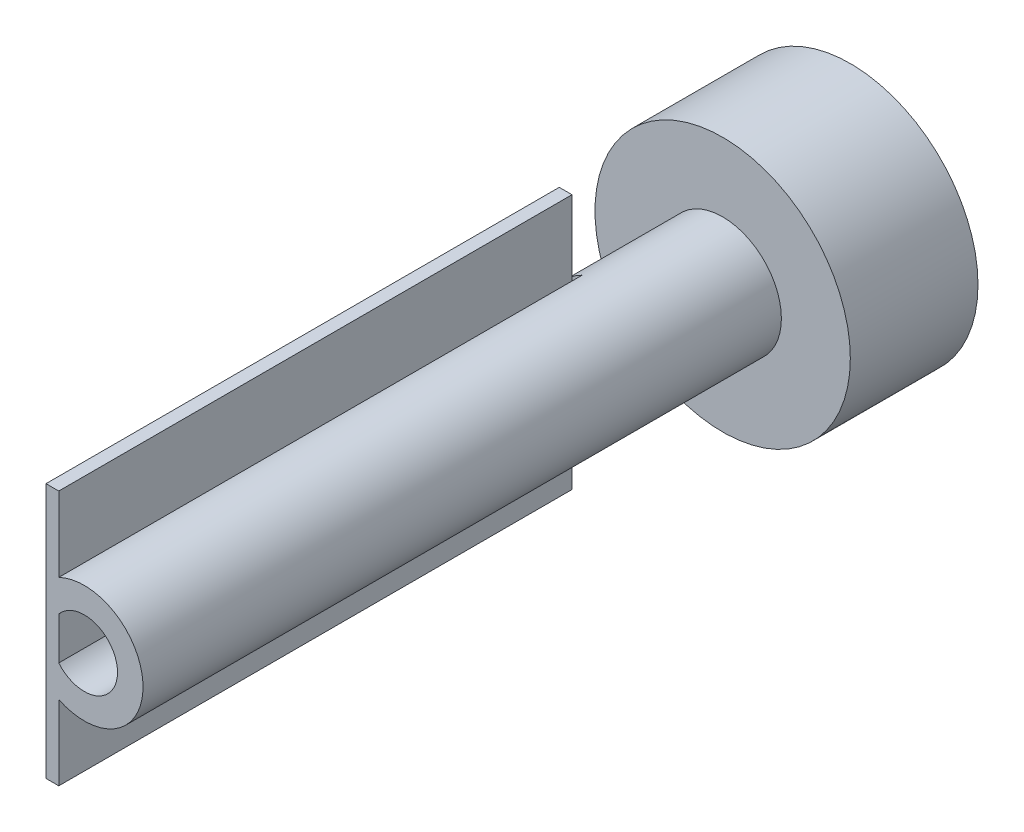
ISO-10303-21;
HEADER;
FILE_DESCRIPTION(('STEP AP214'),'2;1');
FILE_NAME('part.step','',(''),(''),'','','');
FILE_SCHEMA(('AUTOMOTIVE_DESIGN { 1 0 10303 214 1 1 1 1 }'));
ENDSEC;
DATA;
#1=APPLICATION_CONTEXT('core data for automotive mechanical design processes');
#2=APPLICATION_PROTOCOL_DEFINITION('international standard','automotive_design',2000,#1);
#3=PRODUCT_CONTEXT('',#1,'mechanical');
#4=PRODUCT('Part','Part','',(#3));
#5=PRODUCT_RELATED_PRODUCT_CATEGORY('part','',(#4));
#6=PRODUCT_DEFINITION_FORMATION('','',#4);
#7=PRODUCT_DEFINITION_CONTEXT('part definition',#1,'design');
#8=PRODUCT_DEFINITION('design','',#6,#7);
#9=PRODUCT_DEFINITION_SHAPE('','',#8);
#10=(LENGTH_UNIT() NAMED_UNIT(*) SI_UNIT(.MILLI.,.METRE.));
#11=(NAMED_UNIT(*) PLANE_ANGLE_UNIT() SI_UNIT($,.RADIAN.));
#12=(NAMED_UNIT(*) SI_UNIT($,.STERADIAN.) SOLID_ANGLE_UNIT());
#13=UNCERTAINTY_MEASURE_WITH_UNIT(LENGTH_MEASURE(1.E-05),#10,'distance_accuracy_value','');
#14=(GEOMETRIC_REPRESENTATION_CONTEXT(3) GLOBAL_UNCERTAINTY_ASSIGNED_CONTEXT((#13)) GLOBAL_UNIT_ASSIGNED_CONTEXT((#10,
#11,#12)) REPRESENTATION_CONTEXT('',''));
#15=CARTESIAN_POINT('',(0.,0.,0.));
#16=DIRECTION('',(0.,0.,1.));
#17=DIRECTION('',(1.,0.,0.));
#18=AXIS2_PLACEMENT_3D('',#15,#16,#17);
#19=CARTESIAN_POINT('',(-2.,4.1424630354416,19.));
#20=DIRECTION('',(1.,0.,0.));
#21=DIRECTION('',(0.,0.,-1.));
#22=AXIS2_PLACEMENT_3D('',#19,#20,#21);
#23=PLANE('',#22);
#24=DIRECTION('',(0.,1.,0.));
#25=VECTOR('',#24,1.);
#26=CARTESIAN_POINT('',(-2.,10.,19.8));
#27=LINE('',#26,#25);
#28=CARTESIAN_POINT('',(-2.,-4.1424630354416,19.8));
#29=VERTEX_POINT('',#28);
#30=CARTESIAN_POINT('',(-2.,-1.66132477258362,19.8));
#31=VERTEX_POINT('',#30);
#32=EDGE_CURVE('E68',#29,#31,#27,.T.);
#33=ORIENTED_EDGE('',*,*,#32,.T.);
#34=DIRECTION('',(0.,0.,-1.));
#35=VECTOR('',#34,1.);
#36=CARTESIAN_POINT('',(-2.,-1.66132477258362,10.));
#37=LINE('',#36,#35);
#38=CARTESIAN_POINT('',(-2.,-1.66132477258362,19.));
#39=VERTEX_POINT('',#38);
#40=EDGE_CURVE('E207',#31,#39,#37,.T.);
#41=ORIENTED_EDGE('',*,*,#40,.T.);
#42=DIRECTION('',(0.,1.,0.));
#43=VECTOR('',#42,1.);
#44=CARTESIAN_POINT('',(-2.,4.1424630354416,19.));
#45=LINE('',#44,#43);
#46=CARTESIAN_POINT('',(-2.,-4.1424630354416,19.));
#47=VERTEX_POINT('',#46);
#48=EDGE_CURVE('E186',#47,#39,#45,.T.);
#49=ORIENTED_EDGE('',*,*,#48,.F.);
#50=DIRECTION('',(0.,0.,1.));
#51=VECTOR('',#50,1.);
#52=CARTESIAN_POINT('',(-2.,-4.1424630354416,19.));
#53=LINE('',#52,#51);
#54=EDGE_CURVE('E196',#47,#29,#53,.T.);
#55=ORIENTED_EDGE('',*,*,#54,.T.);
#56=EDGE_LOOP('',(#33,#41,#49,#55));
#57=FACE_BOUND('',#56,.T.);
#58=ADVANCED_FACE('F45',(#57),#23,.F.);
#59=DIRECTION('',(0.,-1.,0.));
#60=VECTOR('',#59,1.);
#61=CARTESIAN_POINT('',(-2.,4.1424630354416,19.8));
#62=LINE('',#61,#60);
#63=CARTESIAN_POINT('',(-2.,4.1424630354416,19.8));
#64=VERTEX_POINT('',#63);
#65=CARTESIAN_POINT('',(-2.,1.66132477258362,19.8));
#66=VERTEX_POINT('',#65);
#67=EDGE_CURVE('E11',#64,#66,#62,.T.);
#68=ORIENTED_EDGE('',*,*,#67,.F.);
#69=DIRECTION('',(0.,0.,1.));
#70=VECTOR('',#69,1.);
#71=CARTESIAN_POINT('',(-2.,4.1424630354416,19.));
#72=LINE('',#71,#70);
#73=CARTESIAN_POINT('',(-2.,4.1424630354416,19.));
#74=VERTEX_POINT('',#73);
#75=EDGE_CURVE('E190',#74,#64,#72,.T.);
#76=ORIENTED_EDGE('',*,*,#75,.F.);
#77=CARTESIAN_POINT('',(-2.,1.66132477258362,19.));
#78=VERTEX_POINT('',#77);
#79=EDGE_CURVE('E185',#78,#74,#45,.T.);
#80=ORIENTED_EDGE('',*,*,#79,.F.);
#81=DIRECTION('',(0.,0.,-1.));
#82=VECTOR('',#81,1.);
#83=CARTESIAN_POINT('',(-2.,1.66132477258362,10.));
#84=LINE('',#83,#82);
#85=EDGE_CURVE('E203',#78,#66,#84,.F.);
#86=ORIENTED_EDGE('',*,*,#85,.T.);
#87=EDGE_LOOP('',(#68,#76,#80,#86));
#88=FACE_BOUND('',#87,.T.);
#89=ADVANCED_FACE('F258',(#88),#23,.F.);
#90=CARTESIAN_POINT('',(0.,0.,10.));
#91=DIRECTION('',(0.,0.,1.));
#92=DIRECTION('',(1.,0.,0.));
#93=AXIS2_PLACEMENT_3D('',#90,#91,#92);
#94=PLANE('',#93);
#95=CARTESIAN_POINT('',(0.,0.,10.));
#96=DIRECTION('',(0.,0.,1.));
#97=DIRECTION('',(1.,0.,0.));
#98=AXIS2_PLACEMENT_3D('',#95,#96,#97);
#99=CIRCLE('',#98,10.);
#100=CARTESIAN_POINT('',(10.,0.,10.));
#101=VERTEX_POINT('',#100);
#102=EDGE_CURVE('E54',#101,#101,#99,.T.);
#103=ORIENTED_EDGE('',*,*,#102,.T.);
#104=EDGE_LOOP('',(#103));
#105=FACE_BOUND('',#104,.T.);
#106=CARTESIAN_POINT('',(0.,0.,10.));
#107=DIRECTION('',(0.,0.,1.));
#108=DIRECTION('',(1.,0.,0.));
#109=AXIS2_PLACEMENT_3D('',#106,#107,#108);
#110=CIRCLE('',#109,4.6);
#111=CARTESIAN_POINT('',(4.6,0.,10.));
#112=VERTEX_POINT('',#111);
#113=EDGE_CURVE('E215',#112,#112,#110,.T.);
#114=ORIENTED_EDGE('',*,*,#113,.F.);
#115=EDGE_LOOP('',(#114));
#116=FACE_BOUND('',#115,.T.);
#117=ADVANCED_FACE('F237',(#105,#116),#94,.T.);
#118=CARTESIAN_POINT('',(0.,0.,0.));
#119=DIRECTION('',(0.,0.,1.));
#120=DIRECTION('',(1.,0.,0.));
#121=AXIS2_PLACEMENT_3D('',#118,#119,#120);
#122=PLANE('',#121);
#123=CARTESIAN_POINT('',(0.,0.,0.));
#124=DIRECTION('',(0.,0.,1.));
#125=DIRECTION('',(1.,0.,0.));
#126=AXIS2_PLACEMENT_3D('',#123,#124,#125);
#127=CIRCLE('',#126,10.);
#128=CARTESIAN_POINT('',(10.,0.,0.));
#129=VERTEX_POINT('',#128);
#130=EDGE_CURVE('E226',#129,#129,#127,.T.);
#131=ORIENTED_EDGE('',*,*,#130,.F.);
#132=EDGE_LOOP('',(#131));
#133=FACE_BOUND('',#132,.T.);
#134=CARTESIAN_POINT('',(0.,0.,0.));
#135=DIRECTION('',(0.,0.,1.));
#136=DIRECTION('',(1.,0.,0.));
#137=AXIS2_PLACEMENT_3D('',#134,#135,#136);
#138=CIRCLE('',#137,2.6);
#139=CARTESIAN_POINT('',(2.6,0.,0.));
#140=VERTEX_POINT('',#139);
#141=EDGE_CURVE('E219',#140,#140,#138,.T.);
#142=ORIENTED_EDGE('',*,*,#141,.T.);
#143=EDGE_LOOP('',(#142));
#144=FACE_BOUND('',#143,.T.);
#145=ADVANCED_FACE('F234',(#133,#144),#122,.F.);
#146=CARTESIAN_POINT('',(0.,0.,10.));
#147=DIRECTION('',(0.,0.,-1.));
#148=DIRECTION('',(-1.,0.,0.));
#149=AXIS2_PLACEMENT_3D('',#146,#147,#148);
#150=CYLINDRICAL_SURFACE('',#149,10.);
#151=ORIENTED_EDGE('',*,*,#102,.F.);
#152=EDGE_LOOP('',(#151));
#153=FACE_BOUND('',#152,.T.);
#154=ORIENTED_EDGE('',*,*,#130,.T.);
#155=EDGE_LOOP('',(#154));
#156=FACE_BOUND('',#155,.T.);
#157=ADVANCED_FACE('F47',(#153,#156),#150,.T.);
#158=CARTESIAN_POINT('',(0.,0.,10.));
#159=DIRECTION('',(0.,0.,-1.));
#160=DIRECTION('',(-1.,0.,0.));
#161=AXIS2_PLACEMENT_3D('',#158,#159,#160);
#162=CYLINDRICAL_SURFACE('',#161,2.6);
#163=CARTESIAN_POINT('',(-2.,-1.66132477258362,60.));
#164=VERTEX_POINT('',#163);
#165=EDGE_CURVE('E208',#164,#31,#37,.T.);
#166=ORIENTED_EDGE('',*,*,#165,.F.);
#167=CARTESIAN_POINT('',(0.,0.,60.));
#168=DIRECTION('',(0.,0.,1.));
#169=DIRECTION('',(1.,0.,0.));
#170=AXIS2_PLACEMENT_3D('',#167,#168,#169);
#171=CIRCLE('',#170,2.6);
#172=CARTESIAN_POINT('',(-2.,1.66132477258362,60.));
#173=VERTEX_POINT('',#172);
#174=EDGE_CURVE('E212',#164,#173,#171,.T.);
#175=ORIENTED_EDGE('',*,*,#174,.T.);
#176=EDGE_CURVE('E202',#66,#173,#84,.F.);
#177=ORIENTED_EDGE('',*,*,#176,.F.);
#178=ORIENTED_EDGE('',*,*,#85,.F.);
#179=CARTESIAN_POINT('',(0.,0.,19.));
#180=DIRECTION('',(0.,0.,1.));
#181=DIRECTION('',(1.,0.,0.));
#182=AXIS2_PLACEMENT_3D('',#179,#180,#181);
#183=CIRCLE('',#182,2.6);
#184=EDGE_CURVE('E194',#78,#39,#183,.T.);
#185=ORIENTED_EDGE('',*,*,#184,.T.);
#186=ORIENTED_EDGE('',*,*,#40,.F.);
#187=EDGE_LOOP('',(#166,#175,#177,#178,#185,#186));
#188=FACE_BOUND('',#187,.T.);
#189=ORIENTED_EDGE('',*,*,#141,.F.);
#190=EDGE_LOOP('',(#189));
#191=FACE_BOUND('',#190,.T.);
#192=ADVANCED_FACE('F240',(#188,#191),#162,.F.);
#193=CARTESIAN_POINT('',(0.,0.,60.));
#194=DIRECTION('',(0.,0.,1.));
#195=DIRECTION('',(1.,0.,0.));
#196=AXIS2_PLACEMENT_3D('',#193,#194,#195);
#197=PLANE('',#196);
#198=ORIENTED_EDGE('',*,*,#174,.F.);
#199=DIRECTION('',(0.,1.,0.));
#200=VECTOR('',#199,1.);
#201=CARTESIAN_POINT('',(-2.,10.,60.));
#202=LINE('',#201,#200);
#203=EDGE_CURVE('E172',#164,#173,#202,.T.);
#204=ORIENTED_EDGE('',*,*,#203,.T.);
#205=EDGE_LOOP('',(#198,#204));
#206=FACE_BOUND('',#205,.T.);
#207=CARTESIAN_POINT('',(-2.,-10.,60.));
#208=VERTEX_POINT('',#207);
#209=CARTESIAN_POINT('',(-2.,-4.1424630354416,60.));
#210=VERTEX_POINT('',#209);
#211=EDGE_CURVE('E157',#208,#210,#202,.T.);
#212=ORIENTED_EDGE('',*,*,#211,.T.);
#213=CARTESIAN_POINT('',(0.,0.,60.));
#214=DIRECTION('',(0.,0.,1.));
#215=DIRECTION('',(1.,0.,0.));
#216=AXIS2_PLACEMENT_3D('',#213,#214,#215);
#217=CIRCLE('',#216,4.6);
#218=CARTESIAN_POINT('',(-2.,4.1424630354416,60.));
#219=VERTEX_POINT('',#218);
#220=EDGE_CURVE('E216',#210,#219,#217,.T.);
#221=ORIENTED_EDGE('',*,*,#220,.T.);
#222=CARTESIAN_POINT('',(-2.,10.,60.));
#223=VERTEX_POINT('',#222);
#224=EDGE_CURVE('E169',#219,#223,#202,.T.);
#225=ORIENTED_EDGE('',*,*,#224,.T.);
#226=DIRECTION('',(-1.,0.,0.));
#227=VECTOR('',#226,1.);
#228=CARTESIAN_POINT('',(-3.,10.,60.));
#229=LINE('',#228,#227);
#230=CARTESIAN_POINT('',(-3.,10.,60.));
#231=VERTEX_POINT('',#230);
#232=EDGE_CURVE('E153',#223,#231,#229,.T.);
#233=ORIENTED_EDGE('',*,*,#232,.T.);
#234=DIRECTION('',(0.,-1.,0.));
#235=VECTOR('',#234,1.);
#236=CARTESIAN_POINT('',(-3.,10.,60.));
#237=LINE('',#236,#235);
#238=CARTESIAN_POINT('',(-3.,-10.,60.));
#239=VERTEX_POINT('',#238);
#240=EDGE_CURVE('E164',#231,#239,#237,.T.);
#241=ORIENTED_EDGE('',*,*,#240,.T.);
#242=DIRECTION('',(1.,0.,0.));
#243=VECTOR('',#242,1.);
#244=CARTESIAN_POINT('',(-3.,-10.,60.));
#245=LINE('',#244,#243);
#246=EDGE_CURVE('E129',#239,#208,#245,.T.);
#247=ORIENTED_EDGE('',*,*,#246,.T.);
#248=EDGE_LOOP('',(#212,#221,#225,#233,#241,#247));
#249=FACE_BOUND('',#248,.T.);
#250=ADVANCED_FACE('F242',(#206,#249),#197,.T.);
#251=CARTESIAN_POINT('',(0.,0.,60.));
#252=DIRECTION('',(0.,0.,-1.));
#253=DIRECTION('',(-1.,0.,0.));
#254=AXIS2_PLACEMENT_3D('',#251,#252,#253);
#255=CYLINDRICAL_SURFACE('',#254,4.6);
#256=ORIENTED_EDGE('',*,*,#220,.F.);
#257=EDGE_CURVE('E61',#29,#210,#53,.T.);
#258=ORIENTED_EDGE('',*,*,#257,.F.);
#259=ORIENTED_EDGE('',*,*,#54,.F.);
#260=CARTESIAN_POINT('',(0.,0.,19.));
#261=DIRECTION('',(0.,0.,1.));
#262=DIRECTION('',(1.,0.,0.));
#263=AXIS2_PLACEMENT_3D('',#260,#261,#262);
#264=CIRCLE('',#263,4.6);
#265=EDGE_CURVE('E176',#74,#47,#264,.T.);
#266=ORIENTED_EDGE('',*,*,#265,.F.);
#267=ORIENTED_EDGE('',*,*,#75,.T.);
#268=EDGE_CURVE('E195',#64,#219,#72,.T.);
#269=ORIENTED_EDGE('',*,*,#268,.T.);
#270=EDGE_LOOP('',(#256,#258,#259,#266,#267,#269));
#271=FACE_BOUND('',#270,.T.);
#272=ORIENTED_EDGE('',*,*,#113,.T.);
#273=EDGE_LOOP('',(#272));
#274=FACE_BOUND('',#273,.T.);
#275=ADVANCED_FACE('F249',(#271,#274),#255,.T.);
#276=CARTESIAN_POINT('',(0.,0.,19.));
#277=DIRECTION('',(0.,0.,1.));
#278=DIRECTION('',(1.,0.,0.));
#279=AXIS2_PLACEMENT_3D('',#276,#277,#278);
#280=PLANE('',#279);
#281=ORIENTED_EDGE('',*,*,#79,.T.);
#282=ORIENTED_EDGE('',*,*,#265,.T.);
#283=ORIENTED_EDGE('',*,*,#48,.T.);
#284=ORIENTED_EDGE('',*,*,#184,.F.);
#285=EDGE_LOOP('',(#281,#282,#283,#284));
#286=FACE_BOUND('',#285,.T.);
#287=ADVANCED_FACE('F265',(#286),#280,.T.);
#288=CARTESIAN_POINT('',(-2.,10.,19.8));
#289=DIRECTION('',(1.,0.,0.));
#290=DIRECTION('',(0.,0.,-1.));
#291=AXIS2_PLACEMENT_3D('',#288,#289,#290);
#292=PLANE('',#291);
#293=ORIENTED_EDGE('',*,*,#257,.T.);
#294=ORIENTED_EDGE('',*,*,#211,.F.);
#295=DIRECTION('',(0.,0.,1.));
#296=VECTOR('',#295,1.);
#297=CARTESIAN_POINT('',(-2.,-10.,19.8));
#298=LINE('',#297,#296);
#299=CARTESIAN_POINT('',(-2.,-10.,19.8));
#300=VERTEX_POINT('',#299);
#301=EDGE_CURVE('E135',#300,#208,#298,.T.);
#302=ORIENTED_EDGE('',*,*,#301,.F.);
#303=EDGE_CURVE('E146',#300,#29,#27,.T.);
#304=ORIENTED_EDGE('',*,*,#303,.T.);
#305=EDGE_LOOP('',(#293,#294,#302,#304));
#306=FACE_BOUND('',#305,.T.);
#307=ADVANCED_FACE('F271',(#306),#292,.T.);
#308=ORIENTED_EDGE('',*,*,#268,.F.);
#309=CARTESIAN_POINT('',(-2.,10.,19.8));
#310=VERTEX_POINT('',#309);
#311=EDGE_CURVE('E148',#64,#310,#27,.T.);
#312=ORIENTED_EDGE('',*,*,#311,.T.);
#313=DIRECTION('',(0.,0.,1.));
#314=VECTOR('',#313,1.);
#315=CARTESIAN_POINT('',(-2.,10.,19.8));
#316=LINE('',#315,#314);
#317=EDGE_CURVE('E177',#310,#223,#316,.T.);
#318=ORIENTED_EDGE('',*,*,#317,.T.);
#319=ORIENTED_EDGE('',*,*,#224,.F.);
#320=EDGE_LOOP('',(#308,#312,#318,#319));
#321=FACE_BOUND('',#320,.T.);
#322=ADVANCED_FACE('F318',(#321),#292,.T.);
#323=CARTESIAN_POINT('',(-3.,10.,19.8));
#324=DIRECTION('',(-1.,0.,0.));
#325=DIRECTION('',(0.,0.,1.));
#326=AXIS2_PLACEMENT_3D('',#323,#324,#325);
#327=PLANE('',#326);
#328=ORIENTED_EDGE('',*,*,#240,.F.);
#329=DIRECTION('',(0.,0.,1.));
#330=VECTOR('',#329,1.);
#331=CARTESIAN_POINT('',(-3.,10.,19.8));
#332=LINE('',#331,#330);
#333=CARTESIAN_POINT('',(-3.,10.,19.8));
#334=VERTEX_POINT('',#333);
#335=EDGE_CURVE('E151',#334,#231,#332,.T.);
#336=ORIENTED_EDGE('',*,*,#335,.F.);
#337=DIRECTION('',(0.,-1.,0.));
#338=VECTOR('',#337,1.);
#339=CARTESIAN_POINT('',(-3.,10.,19.8));
#340=LINE('',#339,#338);
#341=CARTESIAN_POINT('',(-3.,-10.,19.8));
#342=VERTEX_POINT('',#341);
#343=EDGE_CURVE('E143',#334,#342,#340,.T.);
#344=ORIENTED_EDGE('',*,*,#343,.T.);
#345=DIRECTION('',(0.,0.,1.));
#346=VECTOR('',#345,1.);
#347=CARTESIAN_POINT('',(-3.,-10.,19.8));
#348=LINE('',#347,#346);
#349=EDGE_CURVE('E124',#342,#239,#348,.T.);
#350=ORIENTED_EDGE('',*,*,#349,.T.);
#351=EDGE_LOOP('',(#328,#336,#344,#350));
#352=FACE_BOUND('',#351,.T.);
#353=ADVANCED_FACE('F150',(#352),#327,.T.);
#354=CARTESIAN_POINT('',(-3.,10.,19.8));
#355=DIRECTION('',(0.,1.,0.));
#356=DIRECTION('',(0.,0.,1.));
#357=AXIS2_PLACEMENT_3D('',#354,#355,#356);
#358=PLANE('',#357);
#359=ORIENTED_EDGE('',*,*,#232,.F.);
#360=ORIENTED_EDGE('',*,*,#317,.F.);
#361=DIRECTION('',(-1.,0.,0.));
#362=VECTOR('',#361,1.);
#363=CARTESIAN_POINT('',(-3.,10.,19.8));
#364=LINE('',#363,#362);
#365=EDGE_CURVE('E136',#310,#334,#364,.T.);
#366=ORIENTED_EDGE('',*,*,#365,.T.);
#367=ORIENTED_EDGE('',*,*,#335,.T.);
#368=EDGE_LOOP('',(#359,#360,#366,#367));
#369=FACE_BOUND('',#368,.T.);
#370=ADVANCED_FACE('F337',(#369),#358,.T.);
#371=ORIENTED_EDGE('',*,*,#203,.F.);
#372=ORIENTED_EDGE('',*,*,#165,.T.);
#373=EDGE_CURVE('E392',#31,#66,#27,.T.);
#374=ORIENTED_EDGE('',*,*,#373,.T.);
#375=ORIENTED_EDGE('',*,*,#176,.T.);
#376=EDGE_LOOP('',(#371,#372,#374,#375));
#377=FACE_BOUND('',#376,.T.);
#378=ADVANCED_FACE('F321',(#377),#292,.T.);
#379=CARTESIAN_POINT('',(-3.,-10.,19.8));
#380=DIRECTION('',(0.,-1.,0.));
#381=DIRECTION('',(0.,0.,-1.));
#382=AXIS2_PLACEMENT_3D('',#379,#380,#381);
#383=PLANE('',#382);
#384=ORIENTED_EDGE('',*,*,#246,.F.);
#385=ORIENTED_EDGE('',*,*,#349,.F.);
#386=DIRECTION('',(1.,0.,0.));
#387=VECTOR('',#386,1.);
#388=CARTESIAN_POINT('',(-3.,-10.,19.8));
#389=LINE('',#388,#387);
#390=EDGE_CURVE('E127',#342,#300,#389,.T.);
#391=ORIENTED_EDGE('',*,*,#390,.T.);
#392=ORIENTED_EDGE('',*,*,#301,.T.);
#393=EDGE_LOOP('',(#384,#385,#391,#392));
#394=FACE_BOUND('',#393,.T.);
#395=ADVANCED_FACE('F126',(#394),#383,.T.);
#396=CARTESIAN_POINT('',(0.,0.,19.8));
#397=DIRECTION('',(0.,0.,1.));
#398=DIRECTION('',(1.,0.,0.));
#399=AXIS2_PLACEMENT_3D('',#396,#397,#398);
#400=PLANE('',#399);
#401=ORIENTED_EDGE('',*,*,#343,.F.);
#402=ORIENTED_EDGE('',*,*,#365,.F.);
#403=ORIENTED_EDGE('',*,*,#311,.F.);
#404=ORIENTED_EDGE('',*,*,#67,.T.);
#405=ORIENTED_EDGE('',*,*,#373,.F.);
#406=ORIENTED_EDGE('',*,*,#32,.F.);
#407=ORIENTED_EDGE('',*,*,#303,.F.);
#408=ORIENTED_EDGE('',*,*,#390,.F.);
#409=EDGE_LOOP('',(#401,#402,#403,#404,#405,#406,#407,#408));
#410=FACE_BOUND('',#409,.T.);
#411=ADVANCED_FACE('F141',(#410),#400,.F.);
#412=CLOSED_SHELL('',(#58,#89,#117,#145,#157,#192,#250,#275,#287,#307,#322,#353,#370,#378,#395,#411));
#413=MANIFOLD_SOLID_BREP('B2',#412);
#414=ADVANCED_BREP_SHAPE_REPRESENTATION('',(#18,#413),#14);
#415=SHAPE_DEFINITION_REPRESENTATION(#9,#414);
ENDSEC;
END-ISO-10303-21;
